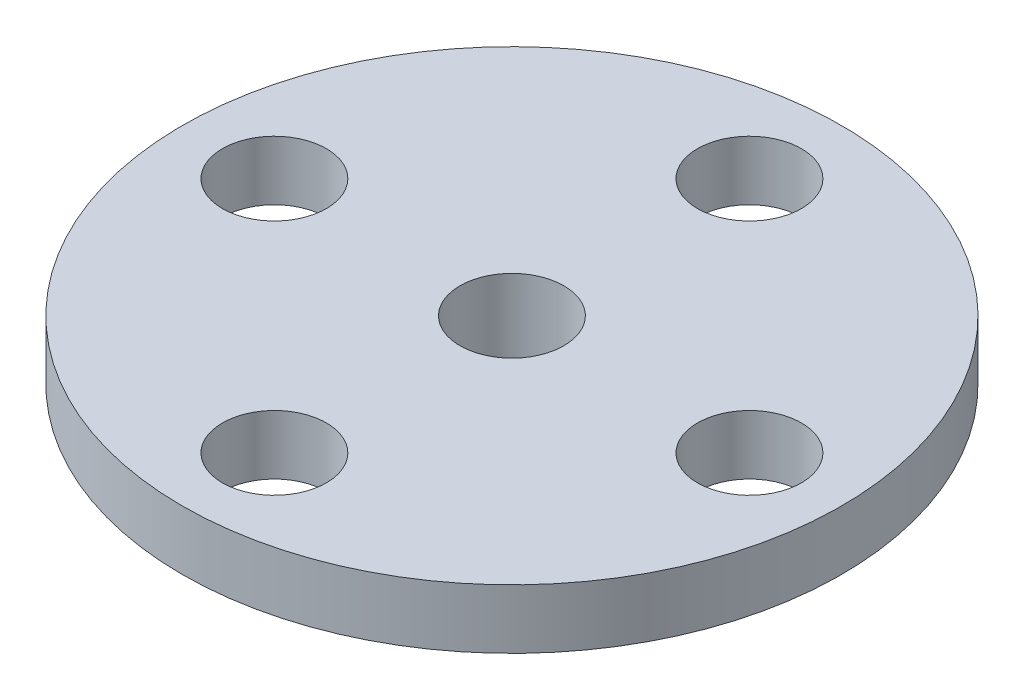
ISO-10303-21;
HEADER;
FILE_DESCRIPTION(('STEP AP214'),'2;1');
FILE_NAME('part.step','',(''),(''),'','','');
FILE_SCHEMA(('AUTOMOTIVE_DESIGN { 1 0 10303 214 1 1 1 1 }'));
ENDSEC;
DATA;
#1=APPLICATION_CONTEXT('core data for automotive mechanical design processes');
#2=APPLICATION_PROTOCOL_DEFINITION('international standard','automotive_design',2000,#1);
#3=PRODUCT_CONTEXT('',#1,'mechanical');
#4=PRODUCT('Part','Part','',(#3));
#5=PRODUCT_RELATED_PRODUCT_CATEGORY('part','',(#4));
#6=PRODUCT_DEFINITION_FORMATION('','',#4);
#7=PRODUCT_DEFINITION_CONTEXT('part definition',#1,'design');
#8=PRODUCT_DEFINITION('design','',#6,#7);
#9=PRODUCT_DEFINITION_SHAPE('','',#8);
#10=(LENGTH_UNIT() NAMED_UNIT(*) SI_UNIT(.MILLI.,.METRE.));
#11=(NAMED_UNIT(*) PLANE_ANGLE_UNIT() SI_UNIT($,.RADIAN.));
#12=(NAMED_UNIT(*) SI_UNIT($,.STERADIAN.) SOLID_ANGLE_UNIT());
#13=UNCERTAINTY_MEASURE_WITH_UNIT(LENGTH_MEASURE(1.E-05),#10,'distance_accuracy_value','');
#14=(GEOMETRIC_REPRESENTATION_CONTEXT(3) GLOBAL_UNCERTAINTY_ASSIGNED_CONTEXT((#13)) GLOBAL_UNIT_ASSIGNED_CONTEXT((#10,
#11,#12)) REPRESENTATION_CONTEXT('',''));
#15=CARTESIAN_POINT('',(0.,0.,0.));
#16=DIRECTION('',(0.,0.,1.));
#17=DIRECTION('',(1.,0.,0.));
#18=AXIS2_PLACEMENT_3D('',#15,#16,#17);
#19=CARTESIAN_POINT('',(0.,0.,0.));
#20=DIRECTION('',(0.,1.,0.));
#21=DIRECTION('',(0.,0.,1.));
#22=AXIS2_PLACEMENT_3D('',#19,#20,#21);
#23=PLANE('',#22);
#24=CARTESIAN_POINT('',(0.,0.,0.));
#25=DIRECTION('',(0.,1.,0.));
#26=DIRECTION('',(0.,0.,1.));
#27=AXIS2_PLACEMENT_3D('',#24,#25,#26);
#28=CIRCLE('',#27,11.1);
#29=CARTESIAN_POINT('',(0.,0.,11.1));
#30=VERTEX_POINT('',#29);
#31=EDGE_CURVE('E49',#30,#30,#28,.T.);
#32=ORIENTED_EDGE('',*,*,#31,.F.);
#33=EDGE_LOOP('',(#32));
#34=FACE_BOUND('',#33,.T.);
#35=CARTESIAN_POINT('',(0.,0.,-8.));
#36=DIRECTION('',(0.,1.,0.));
#37=DIRECTION('',(0.,0.,1.));
#38=AXIS2_PLACEMENT_3D('',#35,#36,#37);
#39=CIRCLE('',#38,1.75);
#40=CARTESIAN_POINT('',(0.,0.,-6.25));
#41=VERTEX_POINT('',#40);
#42=EDGE_CURVE('E56',#41,#41,#39,.T.);
#43=ORIENTED_EDGE('',*,*,#42,.T.);
#44=EDGE_LOOP('',(#43));
#45=FACE_BOUND('',#44,.T.);
#46=CARTESIAN_POINT('',(8.,0.,0.));
#47=DIRECTION('',(0.,1.,0.));
#48=DIRECTION('',(0.,0.,1.));
#49=AXIS2_PLACEMENT_3D('',#46,#47,#48);
#50=CIRCLE('',#49,1.75);
#51=CARTESIAN_POINT('',(8.,0.,1.75));
#52=VERTEX_POINT('',#51);
#53=EDGE_CURVE('E61',#52,#52,#50,.T.);
#54=ORIENTED_EDGE('',*,*,#53,.T.);
#55=EDGE_LOOP('',(#54));
#56=FACE_BOUND('',#55,.T.);
#57=CARTESIAN_POINT('',(0.,0.,8.));
#58=DIRECTION('',(0.,1.,0.));
#59=DIRECTION('',(0.,0.,1.));
#60=AXIS2_PLACEMENT_3D('',#57,#58,#59);
#61=CIRCLE('',#60,1.75);
#62=CARTESIAN_POINT('',(0.,0.,9.75));
#63=VERTEX_POINT('',#62);
#64=EDGE_CURVE('E69',#63,#63,#61,.T.);
#65=ORIENTED_EDGE('',*,*,#64,.T.);
#66=EDGE_LOOP('',(#65));
#67=FACE_BOUND('',#66,.T.);
#68=CARTESIAN_POINT('',(-8.,0.,0.));
#69=DIRECTION('',(0.,1.,0.));
#70=DIRECTION('',(0.,0.,1.));
#71=AXIS2_PLACEMENT_3D('',#68,#69,#70);
#72=CIRCLE('',#71,1.75);
#73=CARTESIAN_POINT('',(-8.,0.,1.75));
#74=VERTEX_POINT('',#73);
#75=EDGE_CURVE('E77',#74,#74,#72,.T.);
#76=ORIENTED_EDGE('',*,*,#75,.T.);
#77=EDGE_LOOP('',(#76));
#78=FACE_BOUND('',#77,.T.);
#79=CARTESIAN_POINT('',(0.,0.,0.));
#80=DIRECTION('',(0.,1.,0.));
#81=DIRECTION('',(0.,0.,1.));
#82=AXIS2_PLACEMENT_3D('',#79,#80,#81);
#83=CIRCLE('',#82,4.4);
#84=CARTESIAN_POINT('',(0.,0.,4.4));
#85=VERTEX_POINT('',#84);
#86=EDGE_CURVE('E10',#85,#85,#83,.F.);
#87=ORIENTED_EDGE('',*,*,#86,.F.);
#88=EDGE_LOOP('',(#87));
#89=FACE_BOUND('',#88,.T.);
#90=ADVANCED_FACE('F34',(#34,#45,#56,#67,#78,#89),#23,.F.);
#91=CARTESIAN_POINT('',(0.,2.,0.));
#92=DIRECTION('',(0.,-1.,0.));
#93=DIRECTION('',(0.,0.,-1.));
#94=AXIS2_PLACEMENT_3D('',#91,#92,#93);
#95=CYLINDRICAL_SURFACE('',#94,11.1);
#96=CARTESIAN_POINT('',(0.,2.,0.));
#97=DIRECTION('',(0.,1.,0.));
#98=DIRECTION('',(0.,0.,1.));
#99=AXIS2_PLACEMENT_3D('',#96,#97,#98);
#100=CIRCLE('',#99,11.1);
#101=CARTESIAN_POINT('',(0.,2.,11.1));
#102=VERTEX_POINT('',#101);
#103=EDGE_CURVE('E42',#102,#102,#100,.T.);
#104=ORIENTED_EDGE('',*,*,#103,.F.);
#105=EDGE_LOOP('',(#104));
#106=FACE_BOUND('',#105,.T.);
#107=ORIENTED_EDGE('',*,*,#31,.T.);
#108=EDGE_LOOP('',(#107));
#109=FACE_BOUND('',#108,.T.);
#110=ADVANCED_FACE('F36',(#106,#109),#95,.T.);
#111=CARTESIAN_POINT('',(0.,2.,0.));
#112=DIRECTION('',(0.,1.,0.));
#113=DIRECTION('',(0.,0.,1.));
#114=AXIS2_PLACEMENT_3D('',#111,#112,#113);
#115=PLANE('',#114);
#116=CARTESIAN_POINT('',(0.,2.,0.));
#117=DIRECTION('',(0.,-1.,0.));
#118=DIRECTION('',(0.,0.,-1.));
#119=AXIS2_PLACEMENT_3D('',#116,#117,#118);
#120=CIRCLE('',#119,1.75);
#121=CARTESIAN_POINT('',(0.,2.,-1.75));
#122=VERTEX_POINT('',#121);
#123=EDGE_CURVE('E97',#122,#122,#120,.T.);
#124=ORIENTED_EDGE('',*,*,#123,.T.);
#125=EDGE_LOOP('',(#124));
#126=FACE_BOUND('',#125,.T.);
#127=CARTESIAN_POINT('',(-8.,2.,0.));
#128=DIRECTION('',(0.,1.,0.));
#129=DIRECTION('',(0.,0.,1.));
#130=AXIS2_PLACEMENT_3D('',#127,#128,#129);
#131=CIRCLE('',#130,1.75);
#132=CARTESIAN_POINT('',(-8.,2.,1.75));
#133=VERTEX_POINT('',#132);
#134=EDGE_CURVE('E81',#133,#133,#131,.T.);
#135=ORIENTED_EDGE('',*,*,#134,.F.);
#136=EDGE_LOOP('',(#135));
#137=FACE_BOUND('',#136,.T.);
#138=CARTESIAN_POINT('',(0.,2.,8.));
#139=DIRECTION('',(0.,1.,0.));
#140=DIRECTION('',(0.,0.,1.));
#141=AXIS2_PLACEMENT_3D('',#138,#139,#140);
#142=CIRCLE('',#141,1.75);
#143=CARTESIAN_POINT('',(0.,2.,9.75));
#144=VERTEX_POINT('',#143);
#145=EDGE_CURVE('E73',#144,#144,#142,.T.);
#146=ORIENTED_EDGE('',*,*,#145,.F.);
#147=EDGE_LOOP('',(#146));
#148=FACE_BOUND('',#147,.T.);
#149=CARTESIAN_POINT('',(8.,2.,0.));
#150=DIRECTION('',(0.,1.,0.));
#151=DIRECTION('',(0.,0.,1.));
#152=AXIS2_PLACEMENT_3D('',#149,#150,#151);
#153=CIRCLE('',#152,1.75);
#154=CARTESIAN_POINT('',(8.,2.,1.75));
#155=VERTEX_POINT('',#154);
#156=EDGE_CURVE('E65',#155,#155,#153,.T.);
#157=ORIENTED_EDGE('',*,*,#156,.F.);
#158=EDGE_LOOP('',(#157));
#159=FACE_BOUND('',#158,.T.);
#160=CARTESIAN_POINT('',(0.,2.,-8.));
#161=DIRECTION('',(0.,1.,0.));
#162=DIRECTION('',(0.,0.,1.));
#163=AXIS2_PLACEMENT_3D('',#160,#161,#162);
#164=CIRCLE('',#163,1.75);
#165=CARTESIAN_POINT('',(0.,2.,-6.25));
#166=VERTEX_POINT('',#165);
#167=EDGE_CURVE('E58',#166,#166,#164,.T.);
#168=ORIENTED_EDGE('',*,*,#167,.F.);
#169=EDGE_LOOP('',(#168));
#170=FACE_BOUND('',#169,.T.);
#171=ORIENTED_EDGE('',*,*,#103,.T.);
#172=EDGE_LOOP('',(#171));
#173=FACE_BOUND('',#172,.T.);
#174=ADVANCED_FACE('F107',(#126,#137,#148,#159,#170,#173),#115,.T.);
#175=CARTESIAN_POINT('',(0.,0.,-8.));
#176=DIRECTION('',(0.,1.,0.));
#177=DIRECTION('',(0.,0.,1.));
#178=AXIS2_PLACEMENT_3D('',#175,#176,#177);
#179=CYLINDRICAL_SURFACE('',#178,1.75);
#180=ORIENTED_EDGE('',*,*,#42,.F.);
#181=EDGE_LOOP('',(#180));
#182=FACE_BOUND('',#181,.T.);
#183=ORIENTED_EDGE('',*,*,#167,.T.);
#184=EDGE_LOOP('',(#183));
#185=FACE_BOUND('',#184,.T.);
#186=ADVANCED_FACE('F155',(#182,#185),#179,.F.);
#187=CARTESIAN_POINT('',(8.,0.,0.));
#188=DIRECTION('',(0.,1.,0.));
#189=DIRECTION('',(0.,0.,1.));
#190=AXIS2_PLACEMENT_3D('',#187,#188,#189);
#191=CYLINDRICAL_SURFACE('',#190,1.75);
#192=ORIENTED_EDGE('',*,*,#53,.F.);
#193=EDGE_LOOP('',(#192));
#194=FACE_BOUND('',#193,.T.);
#195=ORIENTED_EDGE('',*,*,#156,.T.);
#196=EDGE_LOOP('',(#195));
#197=FACE_BOUND('',#196,.T.);
#198=ADVANCED_FACE('F158',(#194,#197),#191,.F.);
#199=CARTESIAN_POINT('',(0.,0.,8.));
#200=DIRECTION('',(0.,1.,0.));
#201=DIRECTION('',(0.,0.,1.));
#202=AXIS2_PLACEMENT_3D('',#199,#200,#201);
#203=CYLINDRICAL_SURFACE('',#202,1.75);
#204=ORIENTED_EDGE('',*,*,#64,.F.);
#205=EDGE_LOOP('',(#204));
#206=FACE_BOUND('',#205,.T.);
#207=ORIENTED_EDGE('',*,*,#145,.T.);
#208=EDGE_LOOP('',(#207));
#209=FACE_BOUND('',#208,.T.);
#210=ADVANCED_FACE('F141',(#206,#209),#203,.F.);
#211=CARTESIAN_POINT('',(-8.,0.,0.));
#212=DIRECTION('',(0.,1.,0.));
#213=DIRECTION('',(0.,0.,1.));
#214=AXIS2_PLACEMENT_3D('',#211,#212,#213);
#215=CYLINDRICAL_SURFACE('',#214,1.75);
#216=ORIENTED_EDGE('',*,*,#75,.F.);
#217=EDGE_LOOP('',(#216));
#218=FACE_BOUND('',#217,.T.);
#219=ORIENTED_EDGE('',*,*,#134,.T.);
#220=EDGE_LOOP('',(#219));
#221=FACE_BOUND('',#220,.T.);
#222=ADVANCED_FACE('F136',(#218,#221),#215,.F.);
#223=CARTESIAN_POINT('',(0.,-4.2,0.));
#224=DIRECTION('',(0.,1.,0.));
#225=DIRECTION('',(0.,0.,1.));
#226=AXIS2_PLACEMENT_3D('',#223,#224,#225);
#227=CYLINDRICAL_SURFACE('',#226,4.4);
#228=CARTESIAN_POINT('',(0.,-4.2,0.));
#229=DIRECTION('',(0.,-1.,0.));
#230=DIRECTION('',(0.,0.,-1.));
#231=AXIS2_PLACEMENT_3D('',#228,#229,#230);
#232=CIRCLE('',#231,4.4);
#233=CARTESIAN_POINT('',(0.,-4.2,-4.4));
#234=VERTEX_POINT('',#233);
#235=EDGE_CURVE('E85',#234,#234,#232,.T.);
#236=ORIENTED_EDGE('',*,*,#235,.F.);
#237=EDGE_LOOP('',(#236));
#238=FACE_BOUND('',#237,.T.);
#239=ORIENTED_EDGE('',*,*,#86,.T.);
#240=EDGE_LOOP('',(#239));
#241=FACE_BOUND('',#240,.T.);
#242=ADVANCED_FACE('F131',(#238,#241),#227,.T.);
#243=CARTESIAN_POINT('',(0.,-4.2,0.));
#244=DIRECTION('',(0.,-1.,0.));
#245=DIRECTION('',(0.,0.,-1.));
#246=AXIS2_PLACEMENT_3D('',#243,#244,#245);
#247=PLANE('',#246);
#248=CARTESIAN_POINT('',(0.,-4.2,0.));
#249=DIRECTION('',(0.,-1.,0.));
#250=DIRECTION('',(0.,0.,-1.));
#251=AXIS2_PLACEMENT_3D('',#248,#249,#250);
#252=CIRCLE('',#251,2.85);
#253=CARTESIAN_POINT('',(0.,-4.2,-2.85));
#254=VERTEX_POINT('',#253);
#255=EDGE_CURVE('E93',#254,#254,#252,.T.);
#256=ORIENTED_EDGE('',*,*,#255,.F.);
#257=EDGE_LOOP('',(#256));
#258=FACE_BOUND('',#257,.T.);
#259=ORIENTED_EDGE('',*,*,#235,.T.);
#260=EDGE_LOOP('',(#259));
#261=FACE_BOUND('',#260,.T.);
#262=ADVANCED_FACE('F125',(#258,#261),#247,.T.);
#263=CARTESIAN_POINT('',(0.,-1.2,0.));
#264=DIRECTION('',(0.,-1.,0.));
#265=DIRECTION('',(0.,0.,-1.));
#266=AXIS2_PLACEMENT_3D('',#263,#264,#265);
#267=CYLINDRICAL_SURFACE('',#266,2.85);
#268=CARTESIAN_POINT('',(0.,-1.2,0.));
#269=DIRECTION('',(0.,-1.,0.));
#270=DIRECTION('',(0.,0.,-1.));
#271=AXIS2_PLACEMENT_3D('',#268,#269,#270);
#272=CIRCLE('',#271,2.85);
#273=CARTESIAN_POINT('',(0.,-1.2,-2.85));
#274=VERTEX_POINT('',#273);
#275=EDGE_CURVE('E92',#274,#274,#272,.T.);
#276=ORIENTED_EDGE('',*,*,#275,.F.);
#277=EDGE_LOOP('',(#276));
#278=FACE_BOUND('',#277,.T.);
#279=ORIENTED_EDGE('',*,*,#255,.T.);
#280=EDGE_LOOP('',(#279));
#281=FACE_BOUND('',#280,.T.);
#282=ADVANCED_FACE('F119',(#278,#281),#267,.F.);
#283=CARTESIAN_POINT('',(0.,-1.2,0.));
#284=DIRECTION('',(0.,-1.,0.));
#285=DIRECTION('',(0.,0.,-1.));
#286=AXIS2_PLACEMENT_3D('',#283,#284,#285);
#287=PLANE('',#286);
#288=CARTESIAN_POINT('',(0.,-1.2,0.));
#289=DIRECTION('',(0.,-1.,0.));
#290=DIRECTION('',(0.,0.,-1.));
#291=AXIS2_PLACEMENT_3D('',#288,#289,#290);
#292=CIRCLE('',#291,1.75);
#293=CARTESIAN_POINT('',(0.,-1.2,-1.75));
#294=VERTEX_POINT('',#293);
#295=EDGE_CURVE('E100',#294,#294,#292,.T.);
#296=ORIENTED_EDGE('',*,*,#295,.F.);
#297=EDGE_LOOP('',(#296));
#298=FACE_BOUND('',#297,.T.);
#299=ORIENTED_EDGE('',*,*,#275,.T.);
#300=EDGE_LOOP('',(#299));
#301=FACE_BOUND('',#300,.T.);
#302=ADVANCED_FACE('F113',(#298,#301),#287,.T.);
#303=CARTESIAN_POINT('',(0.,2.,0.));
#304=DIRECTION('',(0.,-1.,0.));
#305=DIRECTION('',(0.,0.,-1.));
#306=AXIS2_PLACEMENT_3D('',#303,#304,#305);
#307=CYLINDRICAL_SURFACE('',#306,1.75);
#308=ORIENTED_EDGE('',*,*,#123,.F.);
#309=EDGE_LOOP('',(#308));
#310=FACE_BOUND('',#309,.T.);
#311=ORIENTED_EDGE('',*,*,#295,.T.);
#312=EDGE_LOOP('',(#311));
#313=FACE_BOUND('',#312,.T.);
#314=ADVANCED_FACE('F110',(#310,#313),#307,.F.);
#315=CLOSED_SHELL('',(#90,#110,#174,#186,#198,#210,#222,#242,#262,#282,#302,#314));
#316=MANIFOLD_SOLID_BREP('B2',#315);
#317=ADVANCED_BREP_SHAPE_REPRESENTATION('',(#18,#316),#14);
#318=SHAPE_DEFINITION_REPRESENTATION(#9,#317);
ENDSEC;
END-ISO-10303-21;
